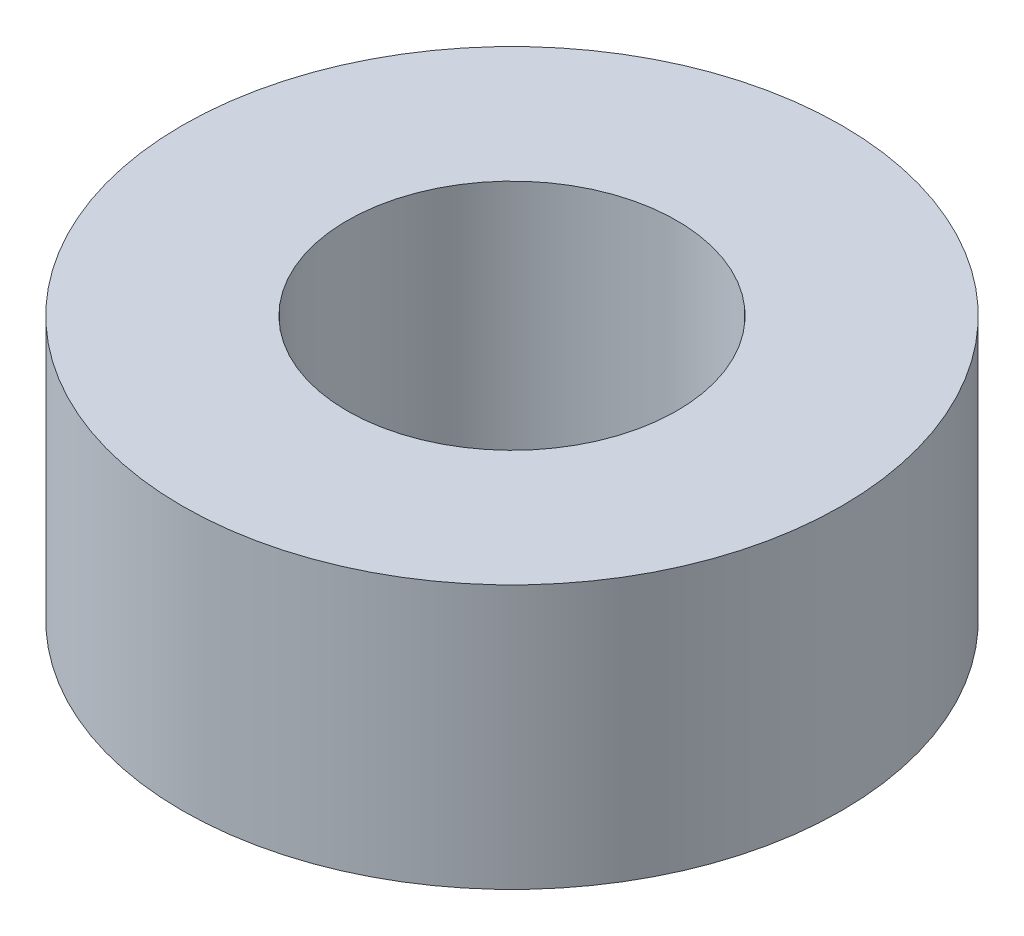
ISO-10303-21;
HEADER;
FILE_DESCRIPTION(('STEP AP214'),'2;1');
FILE_NAME('part.step','',(''),(''),'','','');
FILE_SCHEMA(('AUTOMOTIVE_DESIGN { 1 0 10303 214 1 1 1 1 }'));
ENDSEC;
DATA;
#1=APPLICATION_CONTEXT('core data for automotive mechanical design processes');
#2=APPLICATION_PROTOCOL_DEFINITION('international standard','automotive_design',2000,#1);
#3=PRODUCT_CONTEXT('',#1,'mechanical');
#4=PRODUCT('Part','Part','',(#3));
#5=PRODUCT_RELATED_PRODUCT_CATEGORY('part','',(#4));
#6=PRODUCT_DEFINITION_FORMATION('','',#4);
#7=PRODUCT_DEFINITION_CONTEXT('part definition',#1,'design');
#8=PRODUCT_DEFINITION('design','',#6,#7);
#9=PRODUCT_DEFINITION_SHAPE('','',#8);
#10=(LENGTH_UNIT() NAMED_UNIT(*) SI_UNIT(.MILLI.,.METRE.));
#11=(NAMED_UNIT(*) PLANE_ANGLE_UNIT() SI_UNIT($,.RADIAN.));
#12=(NAMED_UNIT(*) SI_UNIT($,.STERADIAN.) SOLID_ANGLE_UNIT());
#13=UNCERTAINTY_MEASURE_WITH_UNIT(LENGTH_MEASURE(1.E-05),#10,'distance_accuracy_value','');
#14=(GEOMETRIC_REPRESENTATION_CONTEXT(3) GLOBAL_UNCERTAINTY_ASSIGNED_CONTEXT((#13)) GLOBAL_UNIT_ASSIGNED_CONTEXT((#10,
#11,#12)) REPRESENTATION_CONTEXT('',''));
#15=CARTESIAN_POINT('',(0.,0.,0.));
#16=DIRECTION('',(0.,0.,1.));
#17=DIRECTION('',(1.,0.,0.));
#18=AXIS2_PLACEMENT_3D('',#15,#16,#17);
#19=CARTESIAN_POINT('',(0.,2.,0.));
#20=DIRECTION('',(0.,1.,0.));
#21=DIRECTION('',(0.,0.,1.));
#22=AXIS2_PLACEMENT_3D('',#19,#20,#21);
#23=PLANE('',#22);
#24=CARTESIAN_POINT('',(0.,2.,0.));
#25=DIRECTION('',(0.,1.,0.));
#26=DIRECTION('',(0.,0.,1.));
#27=AXIS2_PLACEMENT_3D('',#24,#25,#26);
#28=CIRCLE('',#27,5.);
#29=CARTESIAN_POINT('',(0.,2.,5.));
#30=VERTEX_POINT('',#29);
#31=EDGE_CURVE('E10',#30,#30,#28,.T.);
#32=ORIENTED_EDGE('',*,*,#31,.T.);
#33=EDGE_LOOP('',(#32));
#34=FACE_BOUND('',#33,.T.);
#35=CARTESIAN_POINT('',(0.,2.,0.));
#36=DIRECTION('',(0.,1.,0.));
#37=DIRECTION('',(0.,0.,1.));
#38=AXIS2_PLACEMENT_3D('',#35,#36,#37);
#39=CIRCLE('',#38,2.5);
#40=CARTESIAN_POINT('',(0.,2.,2.5));
#41=VERTEX_POINT('',#40);
#42=EDGE_CURVE('E41',#41,#41,#39,.T.);
#43=ORIENTED_EDGE('',*,*,#42,.F.);
#44=EDGE_LOOP('',(#43));
#45=FACE_BOUND('',#44,.T.);
#46=ADVANCED_FACE('F30',(#34,#45),#23,.T.);
#47=CARTESIAN_POINT('',(0.,-2.,0.));
#48=DIRECTION('',(0.,1.,0.));
#49=DIRECTION('',(0.,0.,1.));
#50=AXIS2_PLACEMENT_3D('',#47,#48,#49);
#51=PLANE('',#50);
#52=CARTESIAN_POINT('',(0.,-2.,0.));
#53=DIRECTION('',(0.,1.,0.));
#54=DIRECTION('',(0.,0.,1.));
#55=AXIS2_PLACEMENT_3D('',#52,#53,#54);
#56=CIRCLE('',#55,5.);
#57=CARTESIAN_POINT('',(0.,-2.,5.));
#58=VERTEX_POINT('',#57);
#59=EDGE_CURVE('E34',#58,#58,#56,.T.);
#60=ORIENTED_EDGE('',*,*,#59,.F.);
#61=EDGE_LOOP('',(#60));
#62=FACE_BOUND('',#61,.T.);
#63=CARTESIAN_POINT('',(0.,-2.,0.));
#64=DIRECTION('',(0.,1.,0.));
#65=DIRECTION('',(0.,0.,1.));
#66=AXIS2_PLACEMENT_3D('',#63,#64,#65);
#67=CIRCLE('',#66,2.5);
#68=CARTESIAN_POINT('',(0.,-2.,2.5));
#69=VERTEX_POINT('',#68);
#70=EDGE_CURVE('E43',#69,#69,#67,.T.);
#71=ORIENTED_EDGE('',*,*,#70,.T.);
#72=EDGE_LOOP('',(#71));
#73=FACE_BOUND('',#72,.T.);
#74=ADVANCED_FACE('F53',(#62,#73),#51,.F.);
#75=CARTESIAN_POINT('',(0.,2.,0.));
#76=DIRECTION('',(0.,-1.,0.));
#77=DIRECTION('',(0.,0.,-1.));
#78=AXIS2_PLACEMENT_3D('',#75,#76,#77);
#79=CYLINDRICAL_SURFACE('',#78,5.);
#80=ORIENTED_EDGE('',*,*,#31,.F.);
#81=EDGE_LOOP('',(#80));
#82=FACE_BOUND('',#81,.T.);
#83=ORIENTED_EDGE('',*,*,#59,.T.);
#84=EDGE_LOOP('',(#83));
#85=FACE_BOUND('',#84,.T.);
#86=ADVANCED_FACE('F32',(#82,#85),#79,.T.);
#87=CARTESIAN_POINT('',(0.,2.,0.));
#88=DIRECTION('',(0.,-1.,0.));
#89=DIRECTION('',(0.,0.,-1.));
#90=AXIS2_PLACEMENT_3D('',#87,#88,#89);
#91=CYLINDRICAL_SURFACE('',#90,2.5);
#92=ORIENTED_EDGE('',*,*,#42,.T.);
#93=EDGE_LOOP('',(#92));
#94=FACE_BOUND('',#93,.T.);
#95=ORIENTED_EDGE('',*,*,#70,.F.);
#96=EDGE_LOOP('',(#95));
#97=FACE_BOUND('',#96,.T.);
#98=ADVANCED_FACE('F49',(#94,#97),#91,.F.);
#99=CLOSED_SHELL('',(#46,#74,#86,#98));
#100=MANIFOLD_SOLID_BREP('B2',#99);
#101=ADVANCED_BREP_SHAPE_REPRESENTATION('',(#18,#100),#14);
#102=SHAPE_DEFINITION_REPRESENTATION(#9,#101);
ENDSEC;
END-ISO-10303-21;
